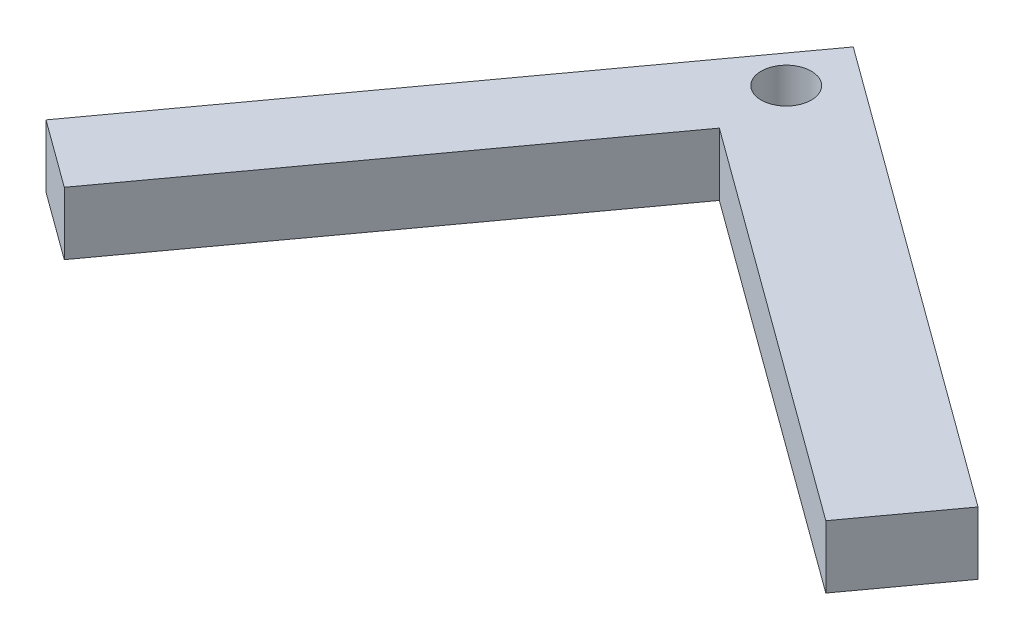
ISO-10303-21;
HEADER;
FILE_DESCRIPTION(('STEP AP214'),'2;1');
FILE_NAME('part.step','',(''),(''),'','','');
FILE_SCHEMA(('AUTOMOTIVE_DESIGN { 1 0 10303 214 1 1 1 1 }'));
ENDSEC;
DATA;
#1=APPLICATION_CONTEXT('core data for automotive mechanical design processes');
#2=APPLICATION_PROTOCOL_DEFINITION('international standard','automotive_design',2000,#1);
#3=PRODUCT_CONTEXT('',#1,'mechanical');
#4=PRODUCT('Part','Part','',(#3));
#5=PRODUCT_RELATED_PRODUCT_CATEGORY('part','',(#4));
#6=PRODUCT_DEFINITION_FORMATION('','',#4);
#7=PRODUCT_DEFINITION_CONTEXT('part definition',#1,'design');
#8=PRODUCT_DEFINITION('design','',#6,#7);
#9=PRODUCT_DEFINITION_SHAPE('','',#8);
#10=(LENGTH_UNIT() NAMED_UNIT(*) SI_UNIT(.MILLI.,.METRE.));
#11=(NAMED_UNIT(*) PLANE_ANGLE_UNIT() SI_UNIT($,.RADIAN.));
#12=(NAMED_UNIT(*) SI_UNIT($,.STERADIAN.) SOLID_ANGLE_UNIT());
#13=UNCERTAINTY_MEASURE_WITH_UNIT(LENGTH_MEASURE(1.E-05),#10,'distance_accuracy_value','');
#14=(GEOMETRIC_REPRESENTATION_CONTEXT(3) GLOBAL_UNCERTAINTY_ASSIGNED_CONTEXT((#13)) GLOBAL_UNIT_ASSIGNED_CONTEXT((#10,
#11,#12)) REPRESENTATION_CONTEXT('',''));
#15=CARTESIAN_POINT('',(0.,0.,0.));
#16=DIRECTION('',(0.,0.,1.));
#17=DIRECTION('',(1.,0.,0.));
#18=AXIS2_PLACEMENT_3D('',#15,#16,#17);
#19=CARTESIAN_POINT('',(23.9023011178696,3.81,17.4316150359398));
#20=DIRECTION('',(-0.807961604492388,0.,-0.589235136143532));
#21=DIRECTION('',(-0.589235136143532,0.,0.807961604492388));
#22=AXIS2_PLACEMENT_3D('',#19,#20,#21);
#23=PLANE('',#22);
#24=DIRECTION('',(0.589235136143532,0.,-0.807961604492388));
#25=VECTOR('',#24,1.);
#26=CARTESIAN_POINT('',(23.9023011178696,0.,17.4316150359398));
#27=LINE('',#26,#25);
#28=CARTESIAN_POINT('',(23.9023011178696,0.,17.4316150359398));
#29=VERTEX_POINT('',#28);
#30=CARTESIAN_POINT('',(27.8032645122279,0.,12.0825982345995));
#31=VERTEX_POINT('',#30);
#32=EDGE_CURVE('E132',#29,#31,#27,.T.);
#33=ORIENTED_EDGE('',*,*,#32,.T.);
#34=DIRECTION('',(0.,-1.,0.));
#35=VECTOR('',#34,1.);
#36=CARTESIAN_POINT('',(27.8032645122279,3.81,12.0825982345995));
#37=LINE('',#36,#35);
#38=CARTESIAN_POINT('',(27.8032645122279,3.81,12.0825982345995));
#39=VERTEX_POINT('',#38);
#40=EDGE_CURVE('E11',#39,#31,#37,.T.);
#41=ORIENTED_EDGE('',*,*,#40,.F.);
#42=DIRECTION('',(0.589235136143532,0.,-0.807961604492388));
#43=VECTOR('',#42,1.);
#44=CARTESIAN_POINT('',(23.9023011178696,3.81,17.4316150359398));
#45=LINE('',#44,#43);
#46=CARTESIAN_POINT('',(23.9023011178696,3.81,17.4316150359398));
#47=VERTEX_POINT('',#46);
#48=EDGE_CURVE('E152',#47,#39,#45,.T.);
#49=ORIENTED_EDGE('',*,*,#48,.F.);
#50=DIRECTION('',(0.,-1.,0.));
#51=VECTOR('',#50,1.);
#52=CARTESIAN_POINT('',(23.9023011178696,3.81,17.4316150359398));
#53=LINE('',#52,#51);
#54=EDGE_CURVE('E128',#47,#29,#53,.T.);
#55=ORIENTED_EDGE('',*,*,#54,.T.);
#56=EDGE_LOOP('',(#33,#41,#49,#55));
#57=FACE_BOUND('',#56,.T.);
#58=ADVANCED_FACE('F45',(#57),#23,.F.);
#59=CARTESIAN_POINT('',(27.8032645122279,3.81,12.0825982345995));
#60=DIRECTION('',(-0.589235136143531,0.,0.807961604492388));
#61=DIRECTION('',(0.807961604492388,0.,0.589235136143531));
#62=AXIS2_PLACEMENT_3D('',#59,#60,#61);
#63=PLANE('',#62);
#64=DIRECTION('',(-0.807961604492388,0.,-0.589235136143531));
#65=VECTOR('',#64,1.);
#66=CARTESIAN_POINT('',(27.8032645122279,0.,12.0825982345995));
#67=LINE('',#66,#65);
#68=CARTESIAN_POINT('',(-0.203481556463037,0.,-8.34233129294946));
#69=VERTEX_POINT('',#68);
#70=EDGE_CURVE('E136',#31,#69,#67,.T.);
#71=ORIENTED_EDGE('',*,*,#70,.T.);
#72=DIRECTION('',(0.,-1.,0.));
#73=VECTOR('',#72,1.);
#74=CARTESIAN_POINT('',(-0.203481556463037,3.81,-8.34233129294946));
#75=LINE('',#74,#73);
#76=CARTESIAN_POINT('',(-0.203481556463037,3.81,-8.34233129294946));
#77=VERTEX_POINT('',#76);
#78=EDGE_CURVE('E54',#77,#69,#75,.T.);
#79=ORIENTED_EDGE('',*,*,#78,.F.);
#80=DIRECTION('',(-0.807961604492388,0.,-0.589235136143531));
#81=VECTOR('',#80,1.);
#82=CARTESIAN_POINT('',(27.8032645122279,3.81,12.0825982345995));
#83=LINE('',#82,#81);
#84=EDGE_CURVE('E95',#39,#77,#83,.T.);
#85=ORIENTED_EDGE('',*,*,#84,.F.);
#86=ORIENTED_EDGE('',*,*,#40,.T.);
#87=EDGE_LOOP('',(#71,#79,#85,#86));
#88=FACE_BOUND('',#87,.T.);
#89=ADVANCED_FACE('F162',(#88),#63,.F.);
#90=CARTESIAN_POINT('',(-20.8955402841774,3.81,20.0307034166139));
#91=DIRECTION('',(-0.807961604492386,0.,-0.589235136143534));
#92=DIRECTION('',(-0.589235136143534,0.,0.807961604492386));
#93=AXIS2_PLACEMENT_3D('',#90,#91,#92);
#94=PLANE('',#93);
#95=DIRECTION('',(0.589235136143534,0.,-0.807961604492386));
#96=VECTOR('',#95,1.);
#97=CARTESIAN_POINT('',(-20.8955402841774,0.,20.0307034166139));
#98=LINE('',#97,#96);
#99=CARTESIAN_POINT('',(-20.8955402841774,0.,20.0307034166139));
#100=VERTEX_POINT('',#99);
#101=EDGE_CURVE('E141',#100,#69,#98,.T.);
#102=ORIENTED_EDGE('',*,*,#101,.F.);
#103=DIRECTION('',(0.,-1.,0.));
#104=VECTOR('',#103,1.);
#105=CARTESIAN_POINT('',(-20.8955402841774,3.81,20.0307034166139));
#106=LINE('',#105,#104);
#107=CARTESIAN_POINT('',(-20.8955402841774,3.81,20.0307034166139));
#108=VERTEX_POINT('',#107);
#109=EDGE_CURVE('E115',#108,#100,#106,.T.);
#110=ORIENTED_EDGE('',*,*,#109,.F.);
#111=DIRECTION('',(0.589235136143534,0.,-0.807961604492386));
#112=VECTOR('',#111,1.);
#113=CARTESIAN_POINT('',(-20.8955402841774,3.81,20.0307034166139));
#114=LINE('',#113,#112);
#115=EDGE_CURVE('E121',#108,#77,#114,.T.);
#116=ORIENTED_EDGE('',*,*,#115,.T.);
#117=ORIENTED_EDGE('',*,*,#78,.T.);
#118=EDGE_LOOP('',(#102,#110,#116,#117));
#119=FACE_BOUND('',#118,.T.);
#120=ADVANCED_FACE('F161',(#119),#94,.T.);
#121=CARTESIAN_POINT('',(-16.7910953333561,3.81,23.024017908223));
#122=DIRECTION('',(-0.589235136143534,0.,0.807961604492386));
#123=DIRECTION('',(0.807961604492386,0.,0.589235136143534));
#124=AXIS2_PLACEMENT_3D('',#121,#122,#123);
#125=PLANE('',#124);
#126=DIRECTION('',(-0.807961604492386,0.,-0.589235136143535));
#127=VECTOR('',#126,1.);
#128=CARTESIAN_POINT('',(-16.7910953333561,0.,23.024017908223));
#129=LINE('',#128,#127);
#130=CARTESIAN_POINT('',(-16.7910953333561,0.,23.024017908223));
#131=VERTEX_POINT('',#130);
#132=EDGE_CURVE('E109',#131,#100,#129,.T.);
#133=ORIENTED_EDGE('',*,*,#132,.F.);
#134=DIRECTION('',(0.,-1.,0.));
#135=VECTOR('',#134,1.);
#136=CARTESIAN_POINT('',(-16.7910953333561,3.81,23.024017908223));
#137=LINE('',#136,#135);
#138=CARTESIAN_POINT('',(-16.7910953333561,3.81,23.024017908223));
#139=VERTEX_POINT('',#138);
#140=EDGE_CURVE('E104',#139,#131,#137,.T.);
#141=ORIENTED_EDGE('',*,*,#140,.F.);
#142=DIRECTION('',(-0.807961604492386,0.,-0.589235136143535));
#143=VECTOR('',#142,1.);
#144=CARTESIAN_POINT('',(-16.7910953333561,3.81,23.024017908223));
#145=LINE('',#144,#143);
#146=EDGE_CURVE('E107',#139,#108,#145,.T.);
#147=ORIENTED_EDGE('',*,*,#146,.T.);
#148=ORIENTED_EDGE('',*,*,#109,.T.);
#149=EDGE_LOOP('',(#133,#141,#147,#148));
#150=FACE_BOUND('',#149,.T.);
#151=ADVANCED_FACE('F106',(#150),#125,.T.);
#152=CARTESIAN_POINT('',(0.,3.81,0.));
#153=DIRECTION('',(0.807961604492386,0.,0.589235136143534));
#154=DIRECTION('',(0.589235136143534,0.,-0.807961604492386));
#155=AXIS2_PLACEMENT_3D('',#152,#153,#154);
#156=PLANE('',#155);
#157=DIRECTION('',(-0.589235136143535,0.,0.807961604492386));
#158=VECTOR('',#157,1.);
#159=CARTESIAN_POINT('',(0.,0.,0.));
#160=LINE('',#159,#158);
#161=CARTESIAN_POINT('',(0.,0.,0.));
#162=VERTEX_POINT('',#161);
#163=EDGE_CURVE('E147',#162,#131,#160,.T.);
#164=ORIENTED_EDGE('',*,*,#163,.F.);
#165=DIRECTION('',(0.,-1.,0.));
#166=VECTOR('',#165,1.);
#167=CARTESIAN_POINT('',(0.,3.81,0.));
#168=LINE('',#167,#166);
#169=CARTESIAN_POINT('',(0.,3.81,0.));
#170=VERTEX_POINT('',#169);
#171=EDGE_CURVE('E84',#170,#162,#168,.T.);
#172=ORIENTED_EDGE('',*,*,#171,.F.);
#173=DIRECTION('',(-0.589235136143535,0.,0.807961604492386));
#174=VECTOR('',#173,1.);
#175=CARTESIAN_POINT('',(0.,3.81,0.));
#176=LINE('',#175,#174);
#177=EDGE_CURVE('E119',#170,#139,#176,.T.);
#178=ORIENTED_EDGE('',*,*,#177,.T.);
#179=ORIENTED_EDGE('',*,*,#140,.T.);
#180=EDGE_LOOP('',(#164,#172,#178,#179));
#181=FACE_BOUND('',#180,.T.);
#182=ADVANCED_FACE('F124',(#181),#156,.T.);
#183=CARTESIAN_POINT('',(0.,3.81,0.));
#184=DIRECTION('',(0.589235136143532,0.,-0.807961604492388));
#185=DIRECTION('',(-0.807961604492388,0.,-0.589235136143532));
#186=AXIS2_PLACEMENT_3D('',#183,#184,#185);
#187=PLANE('',#186);
#188=DIRECTION('',(0.807961604492388,0.,0.589235136143532));
#189=VECTOR('',#188,1.);
#190=CARTESIAN_POINT('',(0.,0.,0.));
#191=LINE('',#190,#189);
#192=EDGE_CURVE('E87',#162,#29,#191,.T.);
#193=ORIENTED_EDGE('',*,*,#192,.T.);
#194=ORIENTED_EDGE('',*,*,#54,.F.);
#195=DIRECTION('',(0.807961604492388,0.,0.589235136143532));
#196=VECTOR('',#195,1.);
#197=CARTESIAN_POINT('',(0.,3.81,0.));
#198=LINE('',#197,#196);
#199=EDGE_CURVE('E62',#170,#47,#198,.T.);
#200=ORIENTED_EDGE('',*,*,#199,.F.);
#201=ORIENTED_EDGE('',*,*,#171,.T.);
#202=EDGE_LOOP('',(#193,#194,#200,#201));
#203=FACE_BOUND('',#202,.T.);
#204=ADVANCED_FACE('F169',(#203),#187,.F.);
#205=CARTESIAN_POINT('',(0.,3.81,0.));
#206=DIRECTION('',(0.,1.,0.));
#207=DIRECTION('',(0.,0.,1.));
#208=AXIS2_PLACEMENT_3D('',#205,#206,#207);
#209=PLANE('',#208);
#210=CARTESIAN_POINT('',(-0.203481556463037,3.81,-4.26828051159255));
#211=DIRECTION('',(0.,1.,0.));
#212=DIRECTION('',(0.,0.,1.));
#213=AXIS2_PLACEMENT_3D('',#210,#211,#212);
#214=CIRCLE('',#213,1.524);
#215=CARTESIAN_POINT('',(-0.203481556463037,3.81,-2.74428051159255));
#216=VERTEX_POINT('',#215);
#217=EDGE_CURVE('E236',#216,#216,#214,.T.);
#218=ORIENTED_EDGE('',*,*,#217,.F.);
#219=EDGE_LOOP('',(#218));
#220=FACE_BOUND('',#219,.T.);
#221=ORIENTED_EDGE('',*,*,#48,.T.);
#222=ORIENTED_EDGE('',*,*,#84,.T.);
#223=ORIENTED_EDGE('',*,*,#115,.F.);
#224=ORIENTED_EDGE('',*,*,#146,.F.);
#225=ORIENTED_EDGE('',*,*,#177,.F.);
#226=ORIENTED_EDGE('',*,*,#199,.T.);
#227=EDGE_LOOP('',(#221,#222,#223,#224,#225,#226));
#228=FACE_BOUND('',#227,.T.);
#229=ADVANCED_FACE('F118',(#220,#228),#209,.T.);
#230=CARTESIAN_POINT('',(0.,0.,0.));
#231=DIRECTION('',(0.,1.,0.));
#232=DIRECTION('',(0.,0.,1.));
#233=AXIS2_PLACEMENT_3D('',#230,#231,#232);
#234=PLANE('',#233);
#235=CARTESIAN_POINT('',(-0.203481556463037,0.,-4.26828051159255));
#236=DIRECTION('',(0.,1.,0.));
#237=DIRECTION('',(0.,0.,1.));
#238=AXIS2_PLACEMENT_3D('',#235,#236,#237);
#239=CIRCLE('',#238,1.524);
#240=CARTESIAN_POINT('',(-0.203481556463037,0.,-2.74428051159255));
#241=VERTEX_POINT('',#240);
#242=EDGE_CURVE('E137',#241,#241,#239,.T.);
#243=ORIENTED_EDGE('',*,*,#242,.T.);
#244=EDGE_LOOP('',(#243));
#245=FACE_BOUND('',#244,.T.);
#246=ORIENTED_EDGE('',*,*,#32,.F.);
#247=ORIENTED_EDGE('',*,*,#192,.F.);
#248=ORIENTED_EDGE('',*,*,#163,.T.);
#249=ORIENTED_EDGE('',*,*,#132,.T.);
#250=ORIENTED_EDGE('',*,*,#101,.T.);
#251=ORIENTED_EDGE('',*,*,#70,.F.);
#252=EDGE_LOOP('',(#246,#247,#248,#249,#250,#251));
#253=FACE_BOUND('',#252,.T.);
#254=ADVANCED_FACE('F166',(#245,#253),#234,.F.);
#255=CARTESIAN_POINT('',(-0.203481556463037,0.,-4.26828051159255));
#256=DIRECTION('',(0.,1.,0.));
#257=DIRECTION('',(0.,0.,1.));
#258=AXIS2_PLACEMENT_3D('',#255,#256,#257);
#259=CYLINDRICAL_SURFACE('',#258,1.524);
#260=ORIENTED_EDGE('',*,*,#242,.F.);
#261=EDGE_LOOP('',(#260));
#262=FACE_BOUND('',#261,.T.);
#263=ORIENTED_EDGE('',*,*,#217,.T.);
#264=EDGE_LOOP('',(#263));
#265=FACE_BOUND('',#264,.T.);
#266=ADVANCED_FACE('F219',(#262,#265),#259,.F.);
#267=CLOSED_SHELL('',(#58,#89,#120,#151,#182,#204,#229,#254,#266));
#268=MANIFOLD_SOLID_BREP('B2',#267);
#269=ADVANCED_BREP_SHAPE_REPRESENTATION('',(#18,#268),#14);
#270=SHAPE_DEFINITION_REPRESENTATION(#9,#269);
ENDSEC;
END-ISO-10303-21;
